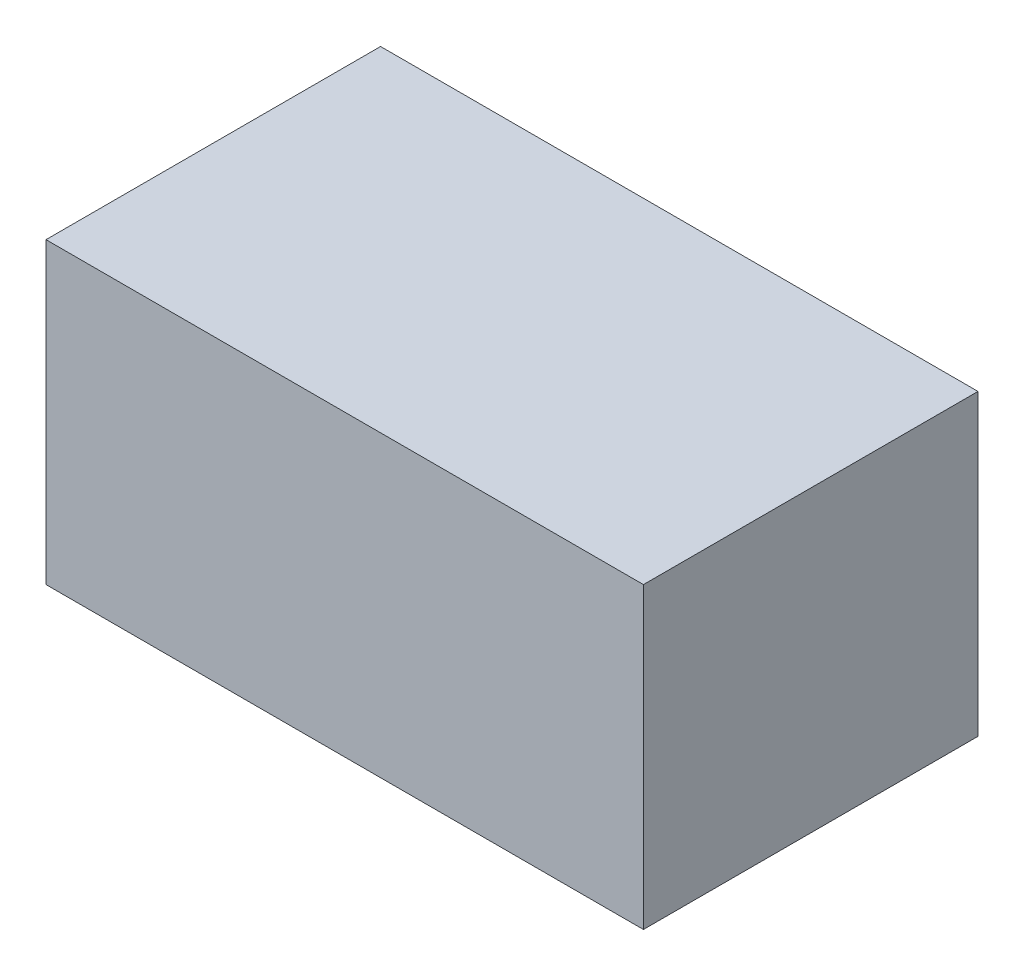
ISO-10303-21;
HEADER;
FILE_DESCRIPTION(('STEP AP214'),'2;1');
FILE_NAME('part.step','',(''),(''),'','','');
FILE_SCHEMA(('AUTOMOTIVE_DESIGN { 1 0 10303 214 1 1 1 1 }'));
ENDSEC;
DATA;
#1=APPLICATION_CONTEXT('core data for automotive mechanical design processes');
#2=APPLICATION_PROTOCOL_DEFINITION('international standard','automotive_design',2000,#1);
#3=PRODUCT_CONTEXT('',#1,'mechanical');
#4=PRODUCT('Part','Part','',(#3));
#5=PRODUCT_RELATED_PRODUCT_CATEGORY('part','',(#4));
#6=PRODUCT_DEFINITION_FORMATION('','',#4);
#7=PRODUCT_DEFINITION_CONTEXT('part definition',#1,'design');
#8=PRODUCT_DEFINITION('design','',#6,#7);
#9=PRODUCT_DEFINITION_SHAPE('','',#8);
#10=(LENGTH_UNIT() NAMED_UNIT(*) SI_UNIT(.MILLI.,.METRE.));
#11=(NAMED_UNIT(*) PLANE_ANGLE_UNIT() SI_UNIT($,.RADIAN.));
#12=(NAMED_UNIT(*) SI_UNIT($,.STERADIAN.) SOLID_ANGLE_UNIT());
#13=UNCERTAINTY_MEASURE_WITH_UNIT(LENGTH_MEASURE(1.E-05),#10,'distance_accuracy_value','');
#14=(GEOMETRIC_REPRESENTATION_CONTEXT(3) GLOBAL_UNCERTAINTY_ASSIGNED_CONTEXT((#13)) GLOBAL_UNIT_ASSIGNED_CONTEXT((#10,
#11,#12)) REPRESENTATION_CONTEXT('',''));
#15=CARTESIAN_POINT('',(0.,0.,0.));
#16=DIRECTION('',(0.,0.,1.));
#17=DIRECTION('',(1.,0.,0.));
#18=AXIS2_PLACEMENT_3D('',#15,#16,#17);
#19=CARTESIAN_POINT('',(0.,0.,28.));
#20=DIRECTION('',(1.,0.,0.));
#21=DIRECTION('',(0.,1.,0.));
#22=AXIS2_PLACEMENT_3D('',#19,#20,#21);
#23=PLANE('',#22);
#24=DIRECTION('',(0.,-1.,0.));
#25=VECTOR('',#24,1.);
#26=CARTESIAN_POINT('',(0.,0.,0.));
#27=LINE('',#26,#25);
#28=CARTESIAN_POINT('',(0.,0.,0.));
#29=VERTEX_POINT('',#28);
#30=CARTESIAN_POINT('',(0.,-25.,0.));
#31=VERTEX_POINT('',#30);
#32=EDGE_CURVE('E100',#29,#31,#27,.T.);
#33=ORIENTED_EDGE('',*,*,#32,.T.);
#34=DIRECTION('',(0.,0.,-1.));
#35=VECTOR('',#34,1.);
#36=CARTESIAN_POINT('',(0.,-25.,28.));
#37=LINE('',#36,#35);
#38=CARTESIAN_POINT('',(0.,-25.,28.));
#39=VERTEX_POINT('',#38);
#40=EDGE_CURVE('E11',#39,#31,#37,.T.);
#41=ORIENTED_EDGE('',*,*,#40,.F.);
#42=DIRECTION('',(0.,-1.,0.));
#43=VECTOR('',#42,1.);
#44=CARTESIAN_POINT('',(0.,0.,28.));
#45=LINE('',#44,#43);
#46=CARTESIAN_POINT('',(0.,0.,28.));
#47=VERTEX_POINT('',#46);
#48=EDGE_CURVE('E88',#47,#39,#45,.T.);
#49=ORIENTED_EDGE('',*,*,#48,.F.);
#50=DIRECTION('',(0.,0.,-1.));
#51=VECTOR('',#50,1.);
#52=CARTESIAN_POINT('',(0.,0.,28.));
#53=LINE('',#52,#51);
#54=EDGE_CURVE('E96',#47,#29,#53,.T.);
#55=ORIENTED_EDGE('',*,*,#54,.T.);
#56=EDGE_LOOP('',(#33,#41,#49,#55));
#57=FACE_BOUND('',#56,.T.);
#58=ADVANCED_FACE('F37',(#57),#23,.F.);
#59=CARTESIAN_POINT('',(0.,-25.,28.));
#60=DIRECTION('',(0.,1.,0.));
#61=DIRECTION('',(0.,0.,1.));
#62=AXIS2_PLACEMENT_3D('',#59,#60,#61);
#63=PLANE('',#62);
#64=DIRECTION('',(1.,0.,0.));
#65=VECTOR('',#64,1.);
#66=CARTESIAN_POINT('',(0.,-25.,0.));
#67=LINE('',#66,#65);
#68=CARTESIAN_POINT('',(50.,-25.,0.));
#69=VERTEX_POINT('',#68);
#70=EDGE_CURVE('E92',#31,#69,#67,.T.);
#71=ORIENTED_EDGE('',*,*,#70,.T.);
#72=DIRECTION('',(0.,0.,-1.));
#73=VECTOR('',#72,1.);
#74=CARTESIAN_POINT('',(50.,-25.,28.));
#75=LINE('',#74,#73);
#76=CARTESIAN_POINT('',(50.,-25.,28.));
#77=VERTEX_POINT('',#76);
#78=EDGE_CURVE('E45',#77,#69,#75,.T.);
#79=ORIENTED_EDGE('',*,*,#78,.F.);
#80=DIRECTION('',(1.,0.,0.));
#81=VECTOR('',#80,1.);
#82=CARTESIAN_POINT('',(0.,-25.,28.));
#83=LINE('',#82,#81);
#84=EDGE_CURVE('E83',#39,#77,#83,.T.);
#85=ORIENTED_EDGE('',*,*,#84,.F.);
#86=ORIENTED_EDGE('',*,*,#40,.T.);
#87=EDGE_LOOP('',(#71,#79,#85,#86));
#88=FACE_BOUND('',#87,.T.);
#89=ADVANCED_FACE('F91',(#88),#63,.F.);
#90=CARTESIAN_POINT('',(50.,0.,28.));
#91=DIRECTION('',(-1.,0.,0.));
#92=DIRECTION('',(0.,-1.,0.));
#93=AXIS2_PLACEMENT_3D('',#90,#91,#92);
#94=PLANE('',#93);
#95=DIRECTION('',(0.,1.,0.));
#96=VECTOR('',#95,1.);
#97=CARTESIAN_POINT('',(50.,0.,0.));
#98=LINE('',#97,#96);
#99=CARTESIAN_POINT('',(50.,0.,0.));
#100=VERTEX_POINT('',#99);
#101=EDGE_CURVE('E70',#69,#100,#98,.T.);
#102=ORIENTED_EDGE('',*,*,#101,.T.);
#103=DIRECTION('',(0.,0.,-1.));
#104=VECTOR('',#103,1.);
#105=CARTESIAN_POINT('',(50.,0.,28.));
#106=LINE('',#105,#104);
#107=CARTESIAN_POINT('',(50.,0.,28.));
#108=VERTEX_POINT('',#107);
#109=EDGE_CURVE('E93',#108,#100,#106,.T.);
#110=ORIENTED_EDGE('',*,*,#109,.F.);
#111=DIRECTION('',(0.,1.,0.));
#112=VECTOR('',#111,1.);
#113=CARTESIAN_POINT('',(50.,0.,28.));
#114=LINE('',#113,#112);
#115=EDGE_CURVE('E86',#77,#108,#114,.T.);
#116=ORIENTED_EDGE('',*,*,#115,.F.);
#117=ORIENTED_EDGE('',*,*,#78,.T.);
#118=EDGE_LOOP('',(#102,#110,#116,#117));
#119=FACE_BOUND('',#118,.T.);
#120=ADVANCED_FACE('F94',(#119),#94,.F.);
#121=CARTESIAN_POINT('',(0.,0.,28.));
#122=DIRECTION('',(0.,-1.,0.));
#123=DIRECTION('',(0.,0.,-1.));
#124=AXIS2_PLACEMENT_3D('',#121,#122,#123);
#125=PLANE('',#124);
#126=DIRECTION('',(-1.,0.,0.));
#127=VECTOR('',#126,1.);
#128=CARTESIAN_POINT('',(0.,0.,0.));
#129=LINE('',#128,#127);
#130=EDGE_CURVE('E76',#100,#29,#129,.T.);
#131=ORIENTED_EDGE('',*,*,#130,.T.);
#132=ORIENTED_EDGE('',*,*,#54,.F.);
#133=DIRECTION('',(-1.,0.,0.));
#134=VECTOR('',#133,1.);
#135=CARTESIAN_POINT('',(0.,0.,28.));
#136=LINE('',#135,#134);
#137=EDGE_CURVE('E53',#108,#47,#136,.T.);
#138=ORIENTED_EDGE('',*,*,#137,.F.);
#139=ORIENTED_EDGE('',*,*,#109,.T.);
#140=EDGE_LOOP('',(#131,#132,#138,#139));
#141=FACE_BOUND('',#140,.T.);
#142=ADVANCED_FACE('F107',(#141),#125,.F.);
#143=CARTESIAN_POINT('',(0.,0.,28.));
#144=DIRECTION('',(0.,0.,1.));
#145=DIRECTION('',(1.,0.,0.));
#146=AXIS2_PLACEMENT_3D('',#143,#144,#145);
#147=PLANE('',#146);
#148=ORIENTED_EDGE('',*,*,#48,.T.);
#149=ORIENTED_EDGE('',*,*,#84,.T.);
#150=ORIENTED_EDGE('',*,*,#115,.T.);
#151=ORIENTED_EDGE('',*,*,#137,.T.);
#152=EDGE_LOOP('',(#148,#149,#150,#151));
#153=FACE_BOUND('',#152,.T.);
#154=ADVANCED_FACE('F84',(#153),#147,.T.);
#155=CARTESIAN_POINT('',(0.,0.,0.));
#156=DIRECTION('',(0.,0.,1.));
#157=DIRECTION('',(1.,0.,0.));
#158=AXIS2_PLACEMENT_3D('',#155,#156,#157);
#159=PLANE('',#158);
#160=ORIENTED_EDGE('',*,*,#32,.F.);
#161=ORIENTED_EDGE('',*,*,#130,.F.);
#162=ORIENTED_EDGE('',*,*,#101,.F.);
#163=ORIENTED_EDGE('',*,*,#70,.F.);
#164=EDGE_LOOP('',(#160,#161,#162,#163));
#165=FACE_BOUND('',#164,.T.);
#166=ADVANCED_FACE('F110',(#165),#159,.F.);
#167=CLOSED_SHELL('',(#58,#89,#120,#142,#154,#166));
#168=MANIFOLD_SOLID_BREP('B2',#167);
#169=ADVANCED_BREP_SHAPE_REPRESENTATION('',(#18,#168),#14);
#170=SHAPE_DEFINITION_REPRESENTATION(#9,#169);
ENDSEC;
END-ISO-10303-21;
